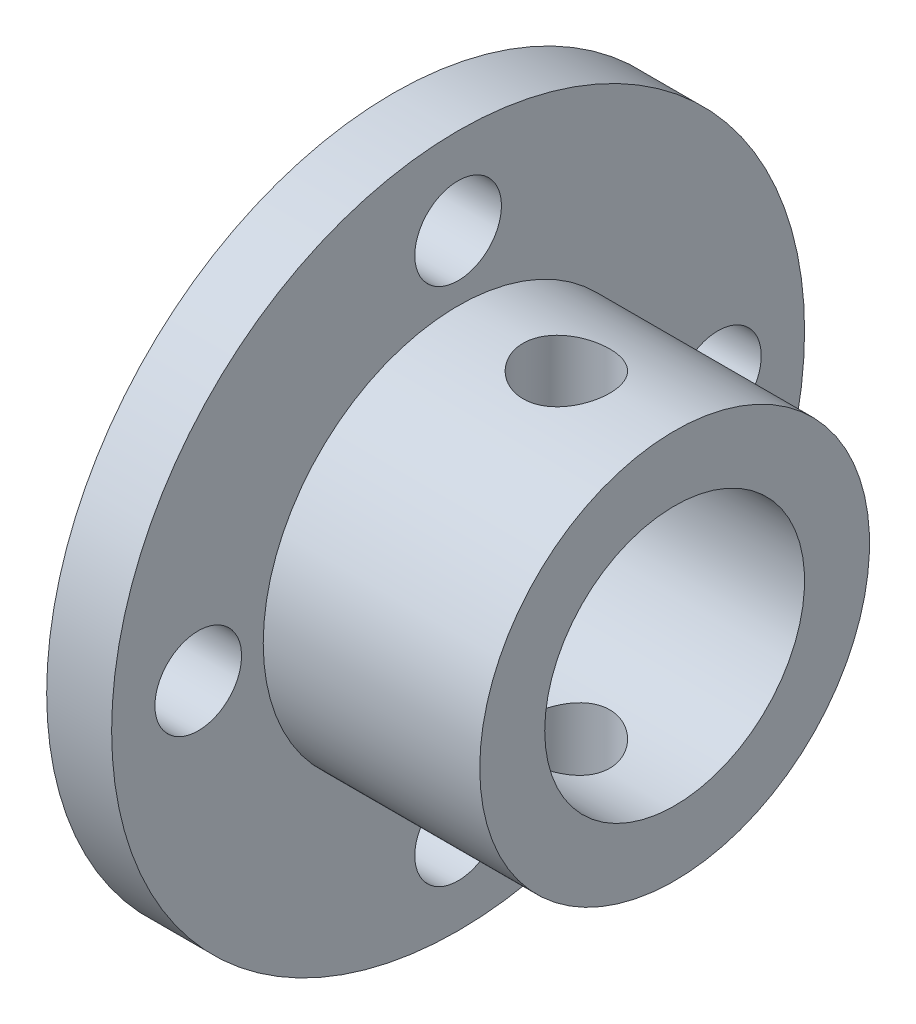
ISO-10303-21;
HEADER;
FILE_DESCRIPTION(('STEP AP214'),'2;1');
FILE_NAME('part.step','',(''),(''),'','','');
FILE_SCHEMA(('AUTOMOTIVE_DESIGN { 1 0 10303 214 1 1 1 1 }'));
ENDSEC;
DATA;
#1=APPLICATION_CONTEXT('core data for automotive mechanical design processes');
#2=APPLICATION_PROTOCOL_DEFINITION('international standard','automotive_design',2000,#1);
#3=PRODUCT_CONTEXT('',#1,'mechanical');
#4=PRODUCT('Part','Part','',(#3));
#5=PRODUCT_RELATED_PRODUCT_CATEGORY('part','',(#4));
#6=PRODUCT_DEFINITION_FORMATION('','',#4);
#7=PRODUCT_DEFINITION_CONTEXT('part definition',#1,'design');
#8=PRODUCT_DEFINITION('design','',#6,#7);
#9=PRODUCT_DEFINITION_SHAPE('','',#8);
#10=(LENGTH_UNIT() NAMED_UNIT(*) SI_UNIT(.MILLI.,.METRE.));
#11=(NAMED_UNIT(*) PLANE_ANGLE_UNIT() SI_UNIT($,.RADIAN.));
#12=(NAMED_UNIT(*) SI_UNIT($,.STERADIAN.) SOLID_ANGLE_UNIT());
#13=UNCERTAINTY_MEASURE_WITH_UNIT(LENGTH_MEASURE(1.E-05),#10,'distance_accuracy_value','');
#14=(GEOMETRIC_REPRESENTATION_CONTEXT(3) GLOBAL_UNCERTAINTY_ASSIGNED_CONTEXT((#13)) GLOBAL_UNIT_ASSIGNED_CONTEXT((#10,
#11,#12)) REPRESENTATION_CONTEXT('',''));
#15=CARTESIAN_POINT('',(0.,0.,0.));
#16=DIRECTION('',(0.,0.,1.));
#17=DIRECTION('',(1.,0.,0.));
#18=AXIS2_PLACEMENT_3D('',#15,#16,#17);
#19=CARTESIAN_POINT('',(0.,0.,0.));
#20=DIRECTION('',(-1.,0.,0.));
#21=DIRECTION('',(0.,0.,1.));
#22=AXIS2_PLACEMENT_3D('',#19,#20,#21);
#23=CYLINDRICAL_SURFACE('',#22,6.);
#24=CARTESIAN_POINT('',(8.,-5.65685424949238,2.));
#25=CARTESIAN_POINT('',(7.89106365032785,-5.65685389060868,2.00000051589543));
#26=CARTESIAN_POINT('',(7.78213040035281,-5.66003538581715,1.99106956737104));
#27=CARTESIAN_POINT('',(7.5674911580115,-5.6723514816251,1.95570226337762));
#28=CARTESIAN_POINT('',(7.46178570025506,-5.68148706284378,1.92926302433679));
#29=CARTESIAN_POINT('',(7.25674621400542,-5.70456407377583,1.85991097136981));
#30=CARTESIAN_POINT('',(7.15740014111456,-5.71849607942644,1.81703044280649));
#31=CARTESIAN_POINT('',(6.96727990290407,-5.74958244020649,1.71612325688276));
#32=CARTESIAN_POINT('',(6.87650763489273,-5.76673750607225,1.65809325772037));
#33=CARTESIAN_POINT('',(6.70256007532337,-5.80308978814946,1.52610229288576));
#34=CARTESIAN_POINT('',(6.61976914265654,-5.82233789689288,1.45164868275584));
#35=CARTESIAN_POINT('',(6.46758639755072,-5.86027729602006,1.28997533442879));
#36=CARTESIAN_POINT('',(6.39819673683526,-5.87896849657923,1.20275355010475));
#37=CARTESIAN_POINT('',(6.27304220534081,-5.91427733843598,1.01520901593002));
#38=CARTESIAN_POINT('',(6.21768005876408,-5.93082815403211,0.914603822449051));
#39=CARTESIAN_POINT('',(6.12481682974498,-5.95939173541966,0.704862445974948));
#40=CARTESIAN_POINT('',(6.08731093364619,-5.97140572406004,0.595728571374424));
#41=CARTESIAN_POINT('',(6.03252829073521,-5.98918150863813,0.376057634866989));
#42=CARTESIAN_POINT('',(6.01459310748598,-5.99514629555118,0.265701509705937));
#43=CARTESIAN_POINT('',(5.99736741327868,-6.00087216436496,0.0433957496481796));
#44=CARTESIAN_POINT('',(5.99807209669517,-6.00063484525791,-0.068553467087792));
#45=CARTESIAN_POINT('',(6.01768850913205,-5.99412079237463,-0.286207030387628));
#46=CARTESIAN_POINT('',(6.03588505694897,-5.98808129510235,-0.391984097183312));
#47=CARTESIAN_POINT('',(6.08878596196094,-5.97093934679463,-0.598886877644342));
#48=CARTESIAN_POINT('',(6.12349143795965,-5.95983655262364,-0.700012275558431));
#49=CARTESIAN_POINT('',(6.20884263461211,-5.93351340586449,-0.896304949683945));
#50=CARTESIAN_POINT('',(6.25969187709302,-5.91824085048031,-0.99137644193769));
#51=CARTESIAN_POINT('',(6.37571941089731,-5.88516786077838,-1.17184865105464));
#52=CARTESIAN_POINT('',(6.44090168665526,-5.86736672402934,-1.25724666877068));
#53=CARTESIAN_POINT('',(6.58734878691939,-5.83012383699793,-1.42020173310261));
#54=CARTESIAN_POINT('',(6.66922631568296,-5.81064430337755,-1.49720031413054));
#55=CARTESIAN_POINT('',(6.84489745145323,-5.77294670497801,-1.63655451919635));
#56=CARTESIAN_POINT('',(6.93869289145608,-5.75472883491231,-1.69890788656309));
#57=CARTESIAN_POINT('',(7.13730725120688,-5.72141050242225,-1.80797491007148));
#58=CARTESIAN_POINT('',(7.24226426263554,-5.70635818569496,-1.85445292724268));
#59=CARTESIAN_POINT('',(7.45914278842883,-5.6816330164877,-1.92888638653867));
#60=CARTESIAN_POINT('',(7.57106136241249,-5.67195790974185,-1.95684959149499));
#61=CARTESIAN_POINT('',(7.79327671082314,-5.6595927263117,-1.99232256419504));
#62=CARTESIAN_POINT('',(7.90341884949731,-5.65660720637512,-2.00069819101527));
#63=CARTESIAN_POINT('',(8.12355229822821,-5.65713344118369,-1.99921087781944));
#64=CARTESIAN_POINT('',(8.23354363204797,-5.66064401583629,-1.98935125045353));
#65=CARTESIAN_POINT('',(8.44631393142382,-5.67347236180599,-1.95245130310462));
#66=CARTESIAN_POINT('',(8.54921086030168,-5.68258650881681,-1.92601278796137));
#67=CARTESIAN_POINT('',(8.74908721247836,-5.70537107342046,-1.85742772512093));
#68=CARTESIAN_POINT('',(8.84606558318156,-5.71904229869679,-1.81527839272684));
#69=CARTESIAN_POINT('',(9.03476084169399,-5.74993755191574,-1.71494868147787));
#70=CARTESIAN_POINT('',(9.1262132852836,-5.76726051331257,-1.65630223671699));
#71=CARTESIAN_POINT('',(9.29829210476743,-5.8033153746193,-1.52517126111512));
#72=CARTESIAN_POINT('',(9.37891527732243,-5.82204768887589,-1.45268265099756));
#73=CARTESIAN_POINT('',(9.53105596818127,-5.85990077275698,-1.29178341180065));
#74=CARTESIAN_POINT('',(9.6019487800377,-5.87899687155793,-1.2027745410933));
#75=CARTESIAN_POINT('',(9.72783228469608,-5.91453703226218,-1.01365458280051));
#76=CARTESIAN_POINT('',(9.78282354232485,-5.9309811883539,-0.913543889729105));
#77=CARTESIAN_POINT('',(9.87484020972343,-5.95928811621206,-0.705559724864592));
#78=CARTESIAN_POINT('',(9.91198255429613,-5.97118060009062,-0.597742246642394));
#79=CARTESIAN_POINT('',(9.96745548412021,-5.98917221675549,-0.376916931692034));
#80=CARTESIAN_POINT('',(9.985792859761,-5.99527344068038,-0.26391098390778));
#81=CARTESIAN_POINT('',(10.0025241552113,-6.00083726472513,-0.0416306717200825));
#82=CARTESIAN_POINT('',(10.0018149078648,-6.00059840178878,0.0675694478400363));
#83=CARTESIAN_POINT('',(9.98268538370718,-5.99424393038796,0.284222290000347));
#84=CARTESIAN_POINT('',(9.96426654369446,-5.98812879867152,0.391675153638113));
#85=CARTESIAN_POINT('',(9.91083553084807,-5.97081829908825,0.600084238864117));
#86=CARTESIAN_POINT('',(9.87609156929413,-5.95970516722297,0.701116541825577));
#87=CARTESIAN_POINT('',(9.79124493780569,-5.9335432140899,0.89595670187959));
#88=CARTESIAN_POINT('',(9.74113948960597,-5.91849368096033,0.989763248284864));
#89=CARTESIAN_POINT('',(9.62486097579598,-5.88531737655762,1.17126803261757));
#90=CARTESIAN_POINT('',(9.55816262923672,-5.86709744983853,1.25861250311521));
#91=CARTESIAN_POINT('',(9.41148521768761,-5.82985977583759,1.42116205254485));
#92=CARTESIAN_POINT('',(9.33150191547454,-5.81084177546194,1.49636324324918));
#93=CARTESIAN_POINT('',(9.1567812888261,-5.77326559651197,1.63548361766623));
#94=CARTESIAN_POINT('',(9.06158897804672,-5.75475455977261,1.6988459319958));
#95=CARTESIAN_POINT('',(8.86133114619444,-5.72120386646031,1.80862868660223));
#96=CARTESIAN_POINT('',(8.75626821394067,-5.70616330322499,1.85505355363895));
#97=CARTESIAN_POINT('',(8.54407635196873,-5.68202668413029,1.92768765640833));
#98=CARTESIAN_POINT('',(8.43725547294926,-5.67269265714364,1.95471581829904));
#99=CARTESIAN_POINT('',(8.22028789906659,-5.66010767079037,1.99086864029853));
#100=CARTESIAN_POINT('',(8.11014236517858,-5.65685461234922,1.99999947839318));
#101=CARTESIAN_POINT('',(8.,-5.65685424949238,2.));
#102=B_SPLINE_CURVE_WITH_KNOTS('',3,(#24,#25,#26,#27,#28,#29,#30,#31,#32,#33,#34,#35,#36,#37,
#38,#39,#40,#41,#42,#43,#44,#45,#46,#47,#48,#49,#50,#51,#52,#53,#54,#55,#56,#57,#58,#59,#60,#61,
#62,#63,#64,#65,#66,#67,#68,#69,#70,#71,#72,#73,#74,#75,#76,#77,#78,#79,#80,#81,#82,#83,#84,#85,
#86,#87,#88,#89,#90,#91,#92,#93,#94,#95,#96,#97,#98,#99,#100,#101),.UNSPECIFIED.,.T.,.F.,(4,2,2,
2,2,2,2,2,2,2,2,2,2,2,2,2,2,2,2,2,2,2,2,2,2,2,2,2,2,2,2,2,2,2,2,2,2,2,4),(0.,0.326401169598711,
0.652856110030327,0.978673255001655,1.30456233237088,1.64202674855136,1.97954530343976,
2.32587012287314,2.67210152773578,3.00628637529868,3.34038506604654,3.66138009651138,
3.98239688378473,4.3076330972067,4.63295983748044,4.97360348727835,5.31429959224212,
5.65985279686111,6.00526102713231,6.33508582728879,6.66485071674467,6.98328791537552,
7.30178158293891,7.63037715471429,7.95906971324254,8.30357616342185,8.64807037515064,
8.99027582381703,9.33235766008313,9.65836169355271,9.98433928019562,10.3051391208086,
10.6259970152648,10.9587103904127,11.2915300886526,11.6373780547229,11.9831355653373,
12.3132642432538,12.6432789438093),.UNSPECIFIED.);
#103=CARTESIAN_POINT('',(8.,-5.65685424949238,2.));
#104=VERTEX_POINT('',#103);
#105=EDGE_CURVE('E107',#104,#104,#102,.T.);
#106=ORIENTED_EDGE('',*,*,#105,.T.);
#107=EDGE_LOOP('',(#106));
#108=FACE_BOUND('',#107,.T.);
#109=CARTESIAN_POINT('',(8.,5.65685424949238,2.));
#110=CARTESIAN_POINT('',(8.10893634967214,5.65685389060868,2.00000051589543));
#111=CARTESIAN_POINT('',(8.21786959964718,5.66003538581715,1.99106956737104));
#112=CARTESIAN_POINT('',(8.4325088419885,5.6723514816251,1.95570226337762));
#113=CARTESIAN_POINT('',(8.53821429974494,5.68148706284378,1.92926302433679));
#114=CARTESIAN_POINT('',(8.74325378599457,5.70456407377583,1.85991097136981));
#115=CARTESIAN_POINT('',(8.84259985888543,5.71849607942644,1.81703044280649));
#116=CARTESIAN_POINT('',(9.03272009709592,5.74958244020649,1.71612325688276));
#117=CARTESIAN_POINT('',(9.12349236510726,5.76673750607225,1.65809325772036));
#118=CARTESIAN_POINT('',(9.29743992467662,5.80308978814946,1.52610229288575));
#119=CARTESIAN_POINT('',(9.38023085734345,5.82233789689288,1.45164868275584));
#120=CARTESIAN_POINT('',(9.53241360244928,5.86027729602006,1.28997533442879));
#121=CARTESIAN_POINT('',(9.60180326316474,5.87896849657923,1.20275355010475));
#122=CARTESIAN_POINT('',(9.72695779465918,5.91427733843598,1.01520901593002));
#123=CARTESIAN_POINT('',(9.78231994123592,5.93082815403211,0.914603822449048));
#124=CARTESIAN_POINT('',(9.87518317025502,5.95939173541966,0.704862445974945));
#125=CARTESIAN_POINT('',(9.91268906635381,5.97140572406004,0.595728571374421));
#126=CARTESIAN_POINT('',(9.96747170926478,5.98918150863813,0.376057634866986));
#127=CARTESIAN_POINT('',(9.98540689251401,5.99514629555118,0.265701509705934));
#128=CARTESIAN_POINT('',(10.0026325867213,6.00087216436496,0.0433957496481766));
#129=CARTESIAN_POINT('',(10.0019279033048,6.00063484525791,-0.0685534670877949));
#130=CARTESIAN_POINT('',(9.98231149086794,5.99412079237463,-0.286207030387631));
#131=CARTESIAN_POINT('',(9.96411494305102,5.98808129510235,-0.391984097183315));
#132=CARTESIAN_POINT('',(9.91121403803905,5.97093934679463,-0.598886877644345));
#133=CARTESIAN_POINT('',(9.87650856204035,5.95983655262364,-0.700012275558434));
#134=CARTESIAN_POINT('',(9.79115736538788,5.93351340586448,-0.896304949683948));
#135=CARTESIAN_POINT('',(9.74030812290697,5.91824085048031,-0.991376441937692));
#136=CARTESIAN_POINT('',(9.62428058910268,5.88516786077838,-1.17184865105465));
#137=CARTESIAN_POINT('',(9.55909831334473,5.86736672402934,-1.25724666877068));
#138=CARTESIAN_POINT('',(9.4126512130806,5.83012383699793,-1.42020173310262));
#139=CARTESIAN_POINT('',(9.33077368431703,5.81064430337755,-1.49720031413055));
#140=CARTESIAN_POINT('',(9.15510254854675,5.77294670497801,-1.63655451919635));
#141=CARTESIAN_POINT('',(9.0613071085439,5.75472883491231,-1.69890788656309));
#142=CARTESIAN_POINT('',(8.86269274879311,5.72141050242225,-1.80797491007149));
#143=CARTESIAN_POINT('',(8.75773573736445,5.70635818569496,-1.85445292724268));
#144=CARTESIAN_POINT('',(8.54085721157116,5.6816330164877,-1.92888638653867));
#145=CARTESIAN_POINT('',(8.4289386375875,5.67195790974185,-1.95684959149499));
#146=CARTESIAN_POINT('',(8.20672328917685,5.6595927263117,-1.99232256419504));
#147=CARTESIAN_POINT('',(8.09658115050268,5.65660720637512,-2.00069819101527));
#148=CARTESIAN_POINT('',(7.87644770177178,5.65713344118369,-1.99921087781944));
#149=CARTESIAN_POINT('',(7.76645636795202,5.66064401583629,-1.98935125045353));
#150=CARTESIAN_POINT('',(7.55368606857618,5.67347236180599,-1.95245130310462));
#151=CARTESIAN_POINT('',(7.45078913969831,5.68258650881681,-1.92601278796137));
#152=CARTESIAN_POINT('',(7.25091278752163,5.70537107342046,-1.85742772512093));
#153=CARTESIAN_POINT('',(7.15393441681843,5.71904229869679,-1.81527839272684));
#154=CARTESIAN_POINT('',(6.965239158306,5.74993755191574,-1.71494868147787));
#155=CARTESIAN_POINT('',(6.87378671471639,5.76726051331257,-1.65630223671699));
#156=CARTESIAN_POINT('',(6.70170789523256,5.80331537461931,-1.52517126111511));
#157=CARTESIAN_POINT('',(6.62108472267756,5.82204768887589,-1.45268265099756));
#158=CARTESIAN_POINT('',(6.46894403181872,5.85990077275698,-1.29178341180065));
#159=CARTESIAN_POINT('',(6.3980512199623,5.87899687155793,-1.2027745410933));
#160=CARTESIAN_POINT('',(6.27216771530391,5.91453703226218,-1.01365458280051));
#161=CARTESIAN_POINT('',(6.21717645767515,5.9309811883539,-0.913543889729103));
#162=CARTESIAN_POINT('',(6.12515979027657,5.95928811621206,-0.70555972486459));
#163=CARTESIAN_POINT('',(6.08801744570387,5.97118060009062,-0.597742246642392));
#164=CARTESIAN_POINT('',(6.03254451587979,5.98917221675549,-0.376916931692031));
#165=CARTESIAN_POINT('',(6.01420714023899,5.99527344068038,-0.263910983907777));
#166=CARTESIAN_POINT('',(5.99747584478871,6.00083726472513,-0.0416306717200801));
#167=CARTESIAN_POINT('',(5.99818509213524,6.00059840178878,0.0675694478400388));
#168=CARTESIAN_POINT('',(6.01731461629281,5.99424393038796,0.284222290000349));
#169=CARTESIAN_POINT('',(6.03573345630554,5.98812879867152,0.391675153638115));
#170=CARTESIAN_POINT('',(6.08916446915192,5.97081829908825,0.600084238864119));
#171=CARTESIAN_POINT('',(6.12390843070586,5.95970516722297,0.701116541825579));
#172=CARTESIAN_POINT('',(6.20875506219431,5.9335432140899,0.895956701879592));
#173=CARTESIAN_POINT('',(6.25886051039402,5.91849368096033,0.989763248284866));
#174=CARTESIAN_POINT('',(6.37513902420401,5.88531737655762,1.17126803261757));
#175=CARTESIAN_POINT('',(6.44183737076328,5.86709744983853,1.25861250311522));
#176=CARTESIAN_POINT('',(6.58851478231239,5.82985977583759,1.42116205254486));
#177=CARTESIAN_POINT('',(6.66849808452545,5.81084177546194,1.49636324324919));
#178=CARTESIAN_POINT('',(6.8432187111739,5.77326559651196,1.63548361766624));
#179=CARTESIAN_POINT('',(6.93841102195328,5.75475455977261,1.6988459319958));
#180=CARTESIAN_POINT('',(7.13866885380556,5.72120386646031,1.80862868660223));
#181=CARTESIAN_POINT('',(7.24373178605933,5.70616330322499,1.85505355363895));
#182=CARTESIAN_POINT('',(7.45592364803126,5.68202668413029,1.92768765640833));
#183=CARTESIAN_POINT('',(7.56274452705073,5.67269265714364,1.95471581829904));
#184=CARTESIAN_POINT('',(7.7797121009334,5.66010767079037,1.99086864029853));
#185=CARTESIAN_POINT('',(7.88985763482142,5.65685461234922,1.99999947839318));
#186=CARTESIAN_POINT('',(8.,5.65685424949238,2.));
#187=B_SPLINE_CURVE_WITH_KNOTS('',3,(#109,#110,#111,#112,#113,#114,#115,#116,#117,#118,#119,
#120,#121,#122,#123,#124,#125,#126,#127,#128,#129,#130,#131,#132,#133,#134,#135,#136,#137,#138,
#139,#140,#141,#142,#143,#144,#145,#146,#147,#148,#149,#150,#151,#152,#153,#154,#155,#156,#157,
#158,#159,#160,#161,#162,#163,#164,#165,#166,#167,#168,#169,#170,#171,#172,#173,#174,#175,#176,
#177,#178,#179,#180,#181,#182,#183,#184,#185,#186),.UNSPECIFIED.,.T.,.F.,(4,2,2,2,2,2,2,2,2,2,2,
2,2,2,2,2,2,2,2,2,2,2,2,2,2,2,2,2,2,2,2,2,2,2,2,2,2,2,4),(0.,0.326401169598711,
0.652856110030329,0.978673255001656,1.30456233237089,1.64202674855136,1.97954530343976,
2.32587012287315,2.67210152773578,3.00628637529869,3.34038506604655,3.66138009651138,
3.98239688378473,4.3076330972067,4.63295983748044,4.97360348727835,5.31429959224212,
5.65985279686111,6.00526102713232,6.33508582728879,6.66485071674468,6.98328791537552,
7.30178158293891,7.6303771547143,7.95906971324255,8.30357616342185,8.64807037515065,
8.99027582381703,9.33235766008313,9.65836169355271,9.98433928019562,10.3051391208086,
10.6259970152649,10.9587103904127,11.2915300886526,11.6373780547229,11.9831355653373,
12.3132642432538,12.6432789438093),.UNSPECIFIED.);
#188=CARTESIAN_POINT('',(8.,5.65685424949238,2.));
#189=VERTEX_POINT('',#188);
#190=EDGE_CURVE('E101',#189,#189,#187,.T.);
#191=ORIENTED_EDGE('',*,*,#190,.T.);
#192=EDGE_LOOP('',(#191));
#193=FACE_BOUND('',#192,.T.);
#194=CARTESIAN_POINT('',(13.,0.,0.));
#195=DIRECTION('',(-1.,0.,0.));
#196=DIRECTION('',(0.,0.,1.));
#197=AXIS2_PLACEMENT_3D('',#194,#195,#196);
#198=CIRCLE('',#197,6.);
#199=CARTESIAN_POINT('',(13.,0.,6.));
#200=VERTEX_POINT('',#199);
#201=EDGE_CURVE('E77',#200,#200,#198,.T.);
#202=ORIENTED_EDGE('',*,*,#201,.F.);
#203=EDGE_LOOP('',(#202));
#204=FACE_BOUND('',#203,.T.);
#205=CARTESIAN_POINT('',(0.,0.,0.));
#206=DIRECTION('',(-1.,0.,0.));
#207=DIRECTION('',(0.,0.,1.));
#208=AXIS2_PLACEMENT_3D('',#205,#206,#207);
#209=CIRCLE('',#208,6.);
#210=CARTESIAN_POINT('',(0.,0.,6.));
#211=VERTEX_POINT('',#210);
#212=EDGE_CURVE('E10',#211,#211,#209,.T.);
#213=ORIENTED_EDGE('',*,*,#212,.T.);
#214=EDGE_LOOP('',(#213));
#215=FACE_BOUND('',#214,.T.);
#216=ADVANCED_FACE('F37',(#108,#193,#204,#215),#23,.F.);
#217=CARTESIAN_POINT('',(0.,6.,0.));
#218=DIRECTION('',(1.,0.,0.));
#219=DIRECTION('',(0.,0.,-1.));
#220=AXIS2_PLACEMENT_3D('',#217,#218,#219);
#221=PLANE('',#220);
#222=CARTESIAN_POINT('',(0.,12.,0.));
#223=DIRECTION('',(-1.,0.,0.));
#224=DIRECTION('',(0.,0.,1.));
#225=AXIS2_PLACEMENT_3D('',#222,#223,#224);
#226=CIRCLE('',#225,2.);
#227=CARTESIAN_POINT('',(0.,12.,2.));
#228=VERTEX_POINT('',#227);
#229=EDGE_CURVE('E66',#228,#228,#226,.T.);
#230=ORIENTED_EDGE('',*,*,#229,.F.);
#231=EDGE_LOOP('',(#230));
#232=FACE_BOUND('',#231,.T.);
#233=CARTESIAN_POINT('',(0.,-3.41060513164848E-13,-11.9999999999997));
#234=DIRECTION('',(-1.,0.,0.));
#235=DIRECTION('',(0.,0.,1.));
#236=AXIS2_PLACEMENT_3D('',#233,#234,#235);
#237=CIRCLE('',#236,2.00000000000055);
#238=CARTESIAN_POINT('',(0.,-3.41060513164848E-13,-9.99999999999912));
#239=VERTEX_POINT('',#238);
#240=EDGE_CURVE('E118',#239,#239,#237,.T.);
#241=ORIENTED_EDGE('',*,*,#240,.F.);
#242=EDGE_LOOP('',(#241));
#243=FACE_BOUND('',#242,.T.);
#244=CARTESIAN_POINT('',(0.,-12.,6.79181874011743E-13));
#245=DIRECTION('',(-1.,0.,0.));
#246=DIRECTION('',(0.,0.,1.));
#247=AXIS2_PLACEMENT_3D('',#244,#245,#246);
#248=CIRCLE('',#247,2.00000000000073);
#249=CARTESIAN_POINT('',(0.,-12.,2.00000000000141));
#250=VERTEX_POINT('',#249);
#251=EDGE_CURVE('E122',#250,#250,#248,.T.);
#252=ORIENTED_EDGE('',*,*,#251,.F.);
#253=EDGE_LOOP('',(#252));
#254=FACE_BOUND('',#253,.T.);
#255=CARTESIAN_POINT('',(0.,3.39590937005871E-13,12.0000000000003));
#256=DIRECTION('',(-1.,0.,0.));
#257=DIRECTION('',(0.,0.,1.));
#258=AXIS2_PLACEMENT_3D('',#255,#256,#257);
#259=CIRCLE('',#258,2.00000000000027);
#260=CARTESIAN_POINT('',(0.,3.39590937005871E-13,14.0000000000006));
#261=VERTEX_POINT('',#260);
#262=EDGE_CURVE('E114',#261,#261,#259,.T.);
#263=ORIENTED_EDGE('',*,*,#262,.F.);
#264=EDGE_LOOP('',(#263));
#265=FACE_BOUND('',#264,.T.);
#266=ORIENTED_EDGE('',*,*,#212,.F.);
#267=EDGE_LOOP('',(#266));
#268=FACE_BOUND('',#267,.T.);
#269=CARTESIAN_POINT('',(0.,0.,0.));
#270=DIRECTION('',(-1.,0.,0.));
#271=DIRECTION('',(0.,0.,1.));
#272=AXIS2_PLACEMENT_3D('',#269,#270,#271);
#273=CIRCLE('',#272,16.);
#274=CARTESIAN_POINT('',(0.,0.,16.));
#275=VERTEX_POINT('',#274);
#276=EDGE_CURVE('E51',#275,#275,#273,.T.);
#277=ORIENTED_EDGE('',*,*,#276,.T.);
#278=EDGE_LOOP('',(#277));
#279=FACE_BOUND('',#278,.T.);
#280=ADVANCED_FACE('F163',(#232,#243,#254,#265,#268,#279),#221,.F.);
#281=CARTESIAN_POINT('',(0.,0.,0.));
#282=DIRECTION('',(-1.,0.,0.));
#283=DIRECTION('',(0.,0.,1.));
#284=AXIS2_PLACEMENT_3D('',#281,#282,#283);
#285=CYLINDRICAL_SURFACE('',#284,16.);
#286=ORIENTED_EDGE('',*,*,#276,.F.);
#287=EDGE_LOOP('',(#286));
#288=FACE_BOUND('',#287,.T.);
#289=CARTESIAN_POINT('',(3.,0.,0.));
#290=DIRECTION('',(-1.,0.,0.));
#291=DIRECTION('',(0.,0.,1.));
#292=AXIS2_PLACEMENT_3D('',#289,#290,#291);
#293=CIRCLE('',#292,16.);
#294=CARTESIAN_POINT('',(3.,0.,16.));
#295=VERTEX_POINT('',#294);
#296=EDGE_CURVE('E57',#295,#295,#293,.T.);
#297=ORIENTED_EDGE('',*,*,#296,.T.);
#298=EDGE_LOOP('',(#297));
#299=FACE_BOUND('',#298,.T.);
#300=ADVANCED_FACE('F143',(#288,#299),#285,.T.);
#301=CARTESIAN_POINT('',(3.,16.,0.));
#302=DIRECTION('',(-1.,0.,0.));
#303=DIRECTION('',(0.,0.,1.));
#304=AXIS2_PLACEMENT_3D('',#301,#302,#303);
#305=PLANE('',#304);
#306=CARTESIAN_POINT('',(3.,12.,0.));
#307=DIRECTION('',(-1.,0.,0.));
#308=DIRECTION('',(0.,0.,1.));
#309=AXIS2_PLACEMENT_3D('',#306,#307,#308);
#310=CIRCLE('',#309,2.);
#311=CARTESIAN_POINT('',(3.,12.,2.));
#312=VERTEX_POINT('',#311);
#313=EDGE_CURVE('E74',#312,#312,#310,.T.);
#314=ORIENTED_EDGE('',*,*,#313,.T.);
#315=EDGE_LOOP('',(#314));
#316=FACE_BOUND('',#315,.T.);
#317=CARTESIAN_POINT('',(3.,-3.41060513164848E-13,-11.9999999999997));
#318=DIRECTION('',(-1.,0.,0.));
#319=DIRECTION('',(0.,0.,1.));
#320=AXIS2_PLACEMENT_3D('',#317,#318,#319);
#321=CIRCLE('',#320,2.00000000000055);
#322=CARTESIAN_POINT('',(3.,-3.41060513164848E-13,-9.99999999999912));
#323=VERTEX_POINT('',#322);
#324=EDGE_CURVE('E70',#323,#323,#321,.T.);
#325=ORIENTED_EDGE('',*,*,#324,.T.);
#326=EDGE_LOOP('',(#325));
#327=FACE_BOUND('',#326,.T.);
#328=CARTESIAN_POINT('',(3.,-12.,6.79181874011743E-13));
#329=DIRECTION('',(-1.,0.,0.));
#330=DIRECTION('',(0.,0.,1.));
#331=AXIS2_PLACEMENT_3D('',#328,#329,#330);
#332=CIRCLE('',#331,2.00000000000073);
#333=CARTESIAN_POINT('',(3.,-12.,2.00000000000141));
#334=VERTEX_POINT('',#333);
#335=EDGE_CURVE('E65',#334,#334,#332,.T.);
#336=ORIENTED_EDGE('',*,*,#335,.T.);
#337=EDGE_LOOP('',(#336));
#338=FACE_BOUND('',#337,.T.);
#339=CARTESIAN_POINT('',(3.,3.39590937005871E-13,12.0000000000003));
#340=DIRECTION('',(-1.,0.,0.));
#341=DIRECTION('',(0.,0.,1.));
#342=AXIS2_PLACEMENT_3D('',#339,#340,#341);
#343=CIRCLE('',#342,2.00000000000027);
#344=CARTESIAN_POINT('',(3.,3.39590937005871E-13,14.0000000000006));
#345=VERTEX_POINT('',#344);
#346=EDGE_CURVE('E61',#345,#345,#343,.T.);
#347=ORIENTED_EDGE('',*,*,#346,.T.);
#348=EDGE_LOOP('',(#347));
#349=FACE_BOUND('',#348,.T.);
#350=ORIENTED_EDGE('',*,*,#296,.F.);
#351=EDGE_LOOP('',(#350));
#352=FACE_BOUND('',#351,.T.);
#353=CARTESIAN_POINT('',(3.,0.,0.));
#354=DIRECTION('',(-1.,0.,0.));
#355=DIRECTION('',(0.,0.,1.));
#356=AXIS2_PLACEMENT_3D('',#353,#354,#355);
#357=CIRCLE('',#356,9.);
#358=CARTESIAN_POINT('',(3.,0.,9.));
#359=VERTEX_POINT('',#358);
#360=EDGE_CURVE('E136',#359,#359,#357,.T.);
#361=ORIENTED_EDGE('',*,*,#360,.T.);
#362=EDGE_LOOP('',(#361));
#363=FACE_BOUND('',#362,.T.);
#364=ADVANCED_FACE('F145',(#316,#327,#338,#349,#352,#363),#305,.F.);
#365=CARTESIAN_POINT('',(0.,0.,0.));
#366=DIRECTION('',(-1.,0.,0.));
#367=DIRECTION('',(0.,0.,1.));
#368=AXIS2_PLACEMENT_3D('',#365,#366,#367);
#369=CYLINDRICAL_SURFACE('',#368,9.);
#370=CARTESIAN_POINT('',(8.,-8.77496438739212,2.));
#371=CARTESIAN_POINT('',(8.11084236771599,-8.77496662645733,1.99999624947948));
#372=CARTESIAN_POINT('',(8.22172941265847,-8.7770874535984,1.99075413145665));
#373=CARTESIAN_POINT('',(8.44034682608887,-8.78532539051412,1.95407223666285));
#374=CARTESIAN_POINT('',(8.54807490341598,-8.7914453293773,1.92661957701425));
#375=CARTESIAN_POINT('',(8.75718042226966,-8.80695492376764,1.85442638312279));
#376=CARTESIAN_POINT('',(8.8585648140004,-8.81634092424592,1.8097051680061));
#377=CARTESIAN_POINT('',(9.05239500705713,-8.83732066308218,1.70430003435311));
#378=CARTESIAN_POINT('',(9.14484093174294,-8.84891437096502,1.64361633615812));
#379=CARTESIAN_POINT('',(9.31978257136839,-8.87322903283376,1.50688107459123));
#380=CARTESIAN_POINT('',(9.40209976211973,-8.88596479825903,1.43060369779219));
#381=CARTESIAN_POINT('',(9.55288275243903,-8.91099903447158,1.26533367886365));
#382=CARTESIAN_POINT('',(9.62134745364365,-8.92329747051937,1.17634002941518));
#383=CARTESIAN_POINT('',(9.74319075139532,-8.94623292801725,0.986963945237562));
#384=CARTESIAN_POINT('',(9.79639724945312,-8.95685043407434,0.886468216533074));
#385=CARTESIAN_POINT('',(9.88509980172048,-8.97506024335485,0.677686335651942));
#386=CARTESIAN_POINT('',(9.92059790847101,-8.98265289716175,0.569401088006952));
#387=CARTESIAN_POINT('',(9.97231343293885,-8.99385284467252,0.349970796328335));
#388=CARTESIAN_POINT('',(9.98883310920039,-8.99752254926932,0.238900228261922));
#389=CARTESIAN_POINT('',(10.0030682708724,-9.00067948952038,0.0155076577860225));
#390=CARTESIAN_POINT('',(10.0007859739338,-9.00016721842944,-0.0968141954765457));
#391=CARTESIAN_POINT('',(9.97770627750396,-8.99506549351281,-0.317435920934347));
#392=CARTESIAN_POINT('',(9.95723472090889,-8.99054779604674,-0.425771784327153));
#393=CARTESIAN_POINT('',(9.89887733244483,-8.97802477302305,-0.637430845543417));
#394=CARTESIAN_POINT('',(9.86099069674674,-8.97001928648017,-0.740753811742809));
#395=CARTESIAN_POINT('',(9.76859302589905,-8.95130538605655,-0.940353769390932));
#396=CARTESIAN_POINT('',(9.71395928345555,-8.94057712552793,-1.03657202089402));
#397=CARTESIAN_POINT('',(9.589709906051,-8.91759271684017,-1.21859313654481));
#398=CARTESIAN_POINT('',(9.52009216893003,-8.9053363543996,-1.30439453662954));
#399=CARTESIAN_POINT('',(9.36607980614704,-8.88033165726825,-1.46508498958083));
#400=CARTESIAN_POINT('',(9.28140002402915,-8.86757840960138,-1.53970021847621));
#401=CARTESIAN_POINT('',(9.10059725238292,-8.84326321441832,-1.67372303020546));
#402=CARTESIAN_POINT('',(9.00447393222571,-8.83170130134042,-1.73313017348813));
#403=CARTESIAN_POINT('',(8.80306011165132,-8.81106433565089,-1.83517765915972));
#404=CARTESIAN_POINT('',(8.69774177719533,-8.8019972048296,-1.8777647744073));
#405=CARTESIAN_POINT('',(8.48119382871771,-8.78748514090364,-1.94455269523168));
#406=CARTESIAN_POINT('',(8.36996518914267,-8.78203961268514,-1.96875652170475));
#407=CARTESIAN_POINT('',(8.14726001294026,-8.77550908494628,-1.99766298900203));
#408=CARTESIAN_POINT('',(8.03583786896013,-8.77433480250859,-2.00276498767797));
#409=CARTESIAN_POINT('',(7.81373507703743,-8.77623864525492,-1.99440547424347));
#410=CARTESIAN_POINT('',(7.70305437694156,-8.77931646812093,-1.98094528187579));
#411=CARTESIAN_POINT('',(7.48697646250341,-8.78929328275126,-1.93619037322696));
#412=CARTESIAN_POINT('',(7.3815310247037,-8.79614483669032,-1.90511692654433));
#413=CARTESIAN_POINT('',(7.17734336887131,-8.81285408505846,-1.82625775138724));
#414=CARTESIAN_POINT('',(7.07860181050054,-8.82271207479827,-1.77847038110013));
#415=CARTESIAN_POINT('',(6.88890039822357,-8.84451874051647,-1.66666470166548));
#416=CARTESIAN_POINT('',(6.79808868501493,-8.85649807643978,-1.60240114470844));
#417=CARTESIAN_POINT('',(6.62839164259131,-8.88111742013187,-1.45978704293772));
#418=CARTESIAN_POINT('',(6.54950784697142,-8.8937575125747,-1.38143468953093));
#419=CARTESIAN_POINT('',(6.40434865649141,-8.91856933927248,-1.21105721461462));
#420=CARTESIAN_POINT('',(6.33834596413054,-8.93072732731512,-1.11879740983627));
#421=CARTESIAN_POINT('',(6.22277586576598,-8.95294911443443,-0.924268162142588));
#422=CARTESIAN_POINT('',(6.17320767936655,-8.96301301294089,-0.821999194813061));
#423=CARTESIAN_POINT('',(6.09228988536659,-8.97985488719582,-0.611001900003295));
#424=CARTESIAN_POINT('',(6.06082280410583,-8.98665400218589,-0.502320388174407));
#425=CARTESIAN_POINT('',(6.01663483998347,-8.99629176699512,-0.28104508679559));
#426=CARTESIAN_POINT('',(6.00391113928615,-8.99913101212837,-0.168451887925187));
#427=CARTESIAN_POINT('',(5.99770121763104,-9.00051075200279,0.0548648455403726));
#428=CARTESIAN_POINT('',(6.00380836934073,-8.99914211230489,0.165576705736198));
#429=CARTESIAN_POINT('',(6.03417495055675,-8.9924552646312,0.384354041366151));
#430=CARTESIAN_POINT('',(6.05843403309503,-8.98713713214866,0.492419567343289));
#431=CARTESIAN_POINT('',(6.12421835719471,-8.97315637064447,0.702510284786642));
#432=CARTESIAN_POINT('',(6.16568422390071,-8.9645052499262,0.804554882640544));
#433=CARTESIAN_POINT('',(6.26464780353945,-8.94478087317809,1.00029152809303));
#434=CARTESIAN_POINT('',(6.32214712618022,-8.93370737397322,1.0939827357907));
#435=CARTESIAN_POINT('',(6.45286227746307,-8.91007482615536,1.27233089950998));
#436=CARTESIAN_POINT('',(6.52636303568944,-8.89749099486293,1.35677575839294));
#437=CARTESIAN_POINT('',(6.68642213645235,-8.87238707177687,1.51227173235308));
#438=CARTESIAN_POINT('',(6.77298363579009,-8.85986699615144,1.58331959999146));
#439=CARTESIAN_POINT('',(6.95815449978795,-8.83611370166478,1.71095851141984));
#440=CARTESIAN_POINT('',(7.05691461674068,-8.82490079106851,1.76733485857975));
#441=CARTESIAN_POINT('',(7.26273689537116,-8.80528840186491,1.86260026324667));
#442=CARTESIAN_POINT('',(7.36979204410565,-8.79688657793932,1.90150390773299));
#443=CARTESIAN_POINT('',(7.56410647405525,-8.78537621740405,1.95389349465735));
#444=CARTESIAN_POINT('',(7.65032342727348,-8.78149804514396,1.97114982047985));
#445=CARTESIAN_POINT('',(7.82435095658017,-8.77629130915146,1.99420426170609));
#446=CARTESIAN_POINT('',(7.91216144967045,-8.77496261301427,2.00000297215128));
#447=CARTESIAN_POINT('',(8.,-8.77496438739212,2.));
#448=B_SPLINE_CURVE_WITH_KNOTS('',3,(#370,#371,#372,#373,#374,#375,#376,#377,#378,#379,#380,
#381,#382,#383,#384,#385,#386,#387,#388,#389,#390,#391,#392,#393,#394,#395,#396,#397,#398,#399,
#400,#401,#402,#403,#404,#405,#406,#407,#408,#409,#410,#411,#412,#413,#414,#415,#416,#417,#418,
#419,#420,#421,#422,#423,#424,#425,#426,#427,#428,#429,#430,#431,#432,#433,#434,#435,#436,#437,
#438,#439,#440,#441,#442,#443,#444,#445,#446,#447),.UNSPECIFIED.,.T.,.F.,(4,2,2,2,2,2,2,2,2,2,2,
2,2,2,2,2,2,2,2,2,2,2,2,2,2,2,2,2,2,2,2,2,2,2,2,2,2,2,4),(0.,0.332205117020653,
0.664645500445896,0.99671504007781,1.32877999616248,1.66604593919643,2.00333861356302,
2.34429812642809,2.68521811023267,3.02062971478989,3.35600175886082,3.68548441840912,
4.0149822874403,4.34695458006495,4.67897347670087,5.01812047297981,5.35727727033735,
5.69749889450325,6.0376645984937,6.37067749516634,6.70366671636337,7.03256257950694,
7.3614907592462,7.69563228727099,8.02981674004573,8.37045046043533,8.71106800344853,
9.04944929455634,9.38777970902403,9.71885587565259,10.0499257140336,10.3798625177933,
10.7098324580937,11.0462446945479,11.3827383729968,11.7239097153546,12.0647957010371,
12.3280698629932,12.5913303516713),.UNSPECIFIED.);
#449=CARTESIAN_POINT('',(8.,-8.77496438739212,2.));
#450=VERTEX_POINT('',#449);
#451=EDGE_CURVE('E41',#450,#450,#448,.T.);
#452=ORIENTED_EDGE('',*,*,#451,.T.);
#453=EDGE_LOOP('',(#452));
#454=FACE_BOUND('',#453,.T.);
#455=CARTESIAN_POINT('',(8.,8.77496438739212,2.));
#456=CARTESIAN_POINT('',(7.88915763228401,8.77496662645733,1.99999624947948));
#457=CARTESIAN_POINT('',(7.77827058734152,8.7770874535984,1.99075413145665));
#458=CARTESIAN_POINT('',(7.55965317391113,8.78532539051412,1.95407223666285));
#459=CARTESIAN_POINT('',(7.45192509658402,8.7914453293773,1.92661957701425));
#460=CARTESIAN_POINT('',(7.24281957773033,8.80695492376764,1.85442638312279));
#461=CARTESIAN_POINT('',(7.1414351859996,8.81634092424592,1.8097051680061));
#462=CARTESIAN_POINT('',(6.94760499294287,8.83732066308218,1.70430003435311));
#463=CARTESIAN_POINT('',(6.85515906825706,8.84891437096502,1.64361633615812));
#464=CARTESIAN_POINT('',(6.68021742863161,8.87322903283376,1.50688107459123));
#465=CARTESIAN_POINT('',(6.59790023788027,8.88596479825903,1.4306036977922));
#466=CARTESIAN_POINT('',(6.44711724756096,8.91099903447158,1.26533367886365));
#467=CARTESIAN_POINT('',(6.37865254635634,8.92329747051937,1.17634002941518));
#468=CARTESIAN_POINT('',(6.25680924860468,8.94623292801725,0.986963945237564));
#469=CARTESIAN_POINT('',(6.20360275054687,8.95685043407434,0.886468216533077));
#470=CARTESIAN_POINT('',(6.11490019827951,8.97506024335485,0.677686335651945));
#471=CARTESIAN_POINT('',(6.07940209152898,8.98265289716175,0.569401088006955));
#472=CARTESIAN_POINT('',(6.02768656706115,8.99385284467252,0.349970796328337));
#473=CARTESIAN_POINT('',(6.0111668907996,8.99752254926932,0.238900228261923));
#474=CARTESIAN_POINT('',(5.99693172912757,9.00067948952038,0.0155076577860246));
#475=CARTESIAN_POINT('',(5.99921402606618,9.00016721842944,-0.0968141954765435));
#476=CARTESIAN_POINT('',(6.02229372249603,8.99506549351281,-0.317435920934345));
#477=CARTESIAN_POINT('',(6.0427652790911,8.99054779604675,-0.425771784327151));
#478=CARTESIAN_POINT('',(6.10112266755516,8.97802477302305,-0.637430845543415));
#479=CARTESIAN_POINT('',(6.13900930325325,8.97001928648017,-0.740753811742807));
#480=CARTESIAN_POINT('',(6.23140697410094,8.95130538605655,-0.94035376939093));
#481=CARTESIAN_POINT('',(6.28604071654444,8.94057712552793,-1.03657202089402));
#482=CARTESIAN_POINT('',(6.41029009394899,8.91759271684017,-1.21859313654481));
#483=CARTESIAN_POINT('',(6.47990783106996,8.9053363543996,-1.30439453662954));
#484=CARTESIAN_POINT('',(6.63392019385295,8.88033165726825,-1.46508498958083));
#485=CARTESIAN_POINT('',(6.71859997597084,8.86757840960138,-1.53970021847621));
#486=CARTESIAN_POINT('',(6.89940274761707,8.84326321441832,-1.67372303020546));
#487=CARTESIAN_POINT('',(6.99552606777428,8.83170130134042,-1.73313017348813));
#488=CARTESIAN_POINT('',(7.19693988834867,8.81106433565089,-1.83517765915972));
#489=CARTESIAN_POINT('',(7.30225822280466,8.8019972048296,-1.8777647744073));
#490=CARTESIAN_POINT('',(7.51880617128228,8.78748514090364,-1.94455269523168));
#491=CARTESIAN_POINT('',(7.63003481085732,8.78203961268514,-1.96875652170475));
#492=CARTESIAN_POINT('',(7.85273998705973,8.77550908494628,-1.99766298900203));
#493=CARTESIAN_POINT('',(7.96416213103986,8.77433480250859,-2.00276498767796));
#494=CARTESIAN_POINT('',(8.18626492296256,8.77623864525492,-1.99440547424347));
#495=CARTESIAN_POINT('',(8.29694562305843,8.77931646812093,-1.98094528187579));
#496=CARTESIAN_POINT('',(8.51302353749658,8.78929328275126,-1.93619037322696));
#497=CARTESIAN_POINT('',(8.61846897529629,8.79614483669032,-1.90511692654434));
#498=CARTESIAN_POINT('',(8.82265663112868,8.81285408505847,-1.82625775138724));
#499=CARTESIAN_POINT('',(8.92139818949945,8.82271207479827,-1.77847038110013));
#500=CARTESIAN_POINT('',(9.11109960177642,8.84451874051647,-1.66666470166548));
#501=CARTESIAN_POINT('',(9.20191131498506,8.85649807643978,-1.60240114470844));
#502=CARTESIAN_POINT('',(9.37160835740869,8.88111742013187,-1.45978704293772));
#503=CARTESIAN_POINT('',(9.45049215302858,8.8937575125747,-1.38143468953094));
#504=CARTESIAN_POINT('',(9.59565134350859,8.91856933927248,-1.21105721461462));
#505=CARTESIAN_POINT('',(9.66165403586945,8.93072732731512,-1.11879740983628));
#506=CARTESIAN_POINT('',(9.77722413423401,8.95294911443443,-0.924268162142589));
#507=CARTESIAN_POINT('',(9.82679232063344,8.96301301294089,-0.821999194813063));
#508=CARTESIAN_POINT('',(9.9077101146334,8.97985488719582,-0.611001900003297));
#509=CARTESIAN_POINT('',(9.93917719589416,8.98665400218589,-0.502320388174408));
#510=CARTESIAN_POINT('',(9.98336516001653,8.99629176699512,-0.281045086795591));
#511=CARTESIAN_POINT('',(9.99608886071384,8.99913101212837,-0.168451887925188));
#512=CARTESIAN_POINT('',(10.002298782369,9.00051075200279,0.0548648455403712));
#513=CARTESIAN_POINT('',(9.99619163065926,8.99914211230489,0.165576705736197));
#514=CARTESIAN_POINT('',(9.96582504944325,8.9924552646312,0.38435404136615));
#515=CARTESIAN_POINT('',(9.94156596690496,8.98713713214866,0.492419567343288));
#516=CARTESIAN_POINT('',(9.87578164280528,8.97315637064447,0.702510284786641));
#517=CARTESIAN_POINT('',(9.83431577609928,8.9645052499262,0.804554882640543));
#518=CARTESIAN_POINT('',(9.73535219646054,8.94478087317809,1.00029152809303));
#519=CARTESIAN_POINT('',(9.67785287381977,8.93370737397322,1.0939827357907));
#520=CARTESIAN_POINT('',(9.54713772253693,8.91007482615536,1.27233089950998));
#521=CARTESIAN_POINT('',(9.47363696431055,8.89749099486293,1.35677575839294));
#522=CARTESIAN_POINT('',(9.31357786354764,8.87238707177687,1.51227173235308));
#523=CARTESIAN_POINT('',(9.22701636420991,8.85986699615144,1.58331959999146));
#524=CARTESIAN_POINT('',(9.04184550021205,8.83611370166478,1.71095851141984));
#525=CARTESIAN_POINT('',(8.94308538325931,8.82490079106851,1.76733485857975));
#526=CARTESIAN_POINT('',(8.73726310462883,8.80528840186491,1.86260026324667));
#527=CARTESIAN_POINT('',(8.63020795589434,8.79688657793932,1.90150390773299));
#528=CARTESIAN_POINT('',(8.43589352594475,8.78537621740405,1.95389349465735));
#529=CARTESIAN_POINT('',(8.34967657272651,8.78149804514396,1.97114982047985));
#530=CARTESIAN_POINT('',(8.17564904341983,8.77629130915146,1.99420426170609));
#531=CARTESIAN_POINT('',(8.08783855032954,8.77496261301427,2.00000297215128));
#532=CARTESIAN_POINT('',(8.,8.77496438739212,2.));
#533=B_SPLINE_CURVE_WITH_KNOTS('',3,(#455,#456,#457,#458,#459,#460,#461,#462,#463,#464,#465,
#466,#467,#468,#469,#470,#471,#472,#473,#474,#475,#476,#477,#478,#479,#480,#481,#482,#483,#484,
#485,#486,#487,#488,#489,#490,#491,#492,#493,#494,#495,#496,#497,#498,#499,#500,#501,#502,#503,
#504,#505,#506,#507,#508,#509,#510,#511,#512,#513,#514,#515,#516,#517,#518,#519,#520,#521,#522,
#523,#524,#525,#526,#527,#528,#529,#530,#531,#532),.UNSPECIFIED.,.T.,.F.,(4,2,2,2,2,2,2,2,2,2,2,
2,2,2,2,2,2,2,2,2,2,2,2,2,2,2,2,2,2,2,2,2,2,2,2,2,2,2,4),(0.,0.332205117020652,
0.664645500445894,0.99671504007781,1.32877999616248,1.66604593919643,2.00333861356301,
2.34429812642809,2.68521811023266,3.02062971478989,3.35600175886081,3.68548441840912,
4.0149822874403,4.34695458006495,4.67897347670086,5.01812047297981,5.35727727033734,
5.69749889450325,6.0376645984937,6.37067749516633,6.70366671636337,7.03256257950694,
7.3614907592462,7.69563228727099,8.02981674004573,8.37045046043533,8.71106800344854,
9.04944929455634,9.38777970902403,9.71885587565259,10.0499257140336,10.3798625177934,
10.7098324580937,11.0462446945479,11.3827383729968,11.7239097153546,12.0647957010371,
12.3280698629932,12.5913303516713),.UNSPECIFIED.);
#534=CARTESIAN_POINT('',(8.,8.77496438739212,2.));
#535=VERTEX_POINT('',#534);
#536=EDGE_CURVE('E78',#535,#535,#533,.T.);
#537=ORIENTED_EDGE('',*,*,#536,.T.);
#538=EDGE_LOOP('',(#537));
#539=FACE_BOUND('',#538,.T.);
#540=ORIENTED_EDGE('',*,*,#360,.F.);
#541=EDGE_LOOP('',(#540));
#542=FACE_BOUND('',#541,.T.);
#543=CARTESIAN_POINT('',(13.,0.,0.));
#544=DIRECTION('',(-1.,0.,0.));
#545=DIRECTION('',(0.,0.,1.));
#546=AXIS2_PLACEMENT_3D('',#543,#544,#545);
#547=CIRCLE('',#546,9.);
#548=CARTESIAN_POINT('',(13.,0.,9.));
#549=VERTEX_POINT('',#548);
#550=EDGE_CURVE('E132',#549,#549,#547,.T.);
#551=ORIENTED_EDGE('',*,*,#550,.T.);
#552=EDGE_LOOP('',(#551));
#553=FACE_BOUND('',#552,.T.);
#554=ADVANCED_FACE('F84',(#454,#539,#542,#553),#369,.T.);
#555=CARTESIAN_POINT('',(13.,9.,0.));
#556=DIRECTION('',(-1.,0.,0.));
#557=DIRECTION('',(0.,0.,1.));
#558=AXIS2_PLACEMENT_3D('',#555,#556,#557);
#559=PLANE('',#558);
#560=ORIENTED_EDGE('',*,*,#550,.F.);
#561=EDGE_LOOP('',(#560));
#562=FACE_BOUND('',#561,.T.);
#563=ORIENTED_EDGE('',*,*,#201,.T.);
#564=EDGE_LOOP('',(#563));
#565=FACE_BOUND('',#564,.T.);
#566=ADVANCED_FACE('F153',(#562,#565),#559,.F.);
#567=CARTESIAN_POINT('',(13.,3.39590937005871E-13,12.0000000000003));
#568=DIRECTION('',(-1.,0.,0.));
#569=DIRECTION('',(0.,0.,1.));
#570=AXIS2_PLACEMENT_3D('',#567,#568,#569);
#571=CYLINDRICAL_SURFACE('',#570,2.00000000000027);
#572=ORIENTED_EDGE('',*,*,#262,.T.);
#573=EDGE_LOOP('',(#572));
#574=FACE_BOUND('',#573,.T.);
#575=ORIENTED_EDGE('',*,*,#346,.F.);
#576=EDGE_LOOP('',(#575));
#577=FACE_BOUND('',#576,.T.);
#578=ADVANCED_FACE('F159',(#574,#577),#571,.F.);
#579=CARTESIAN_POINT('',(13.,-12.,6.79181874011743E-13));
#580=DIRECTION('',(-1.,0.,0.));
#581=DIRECTION('',(0.,0.,1.));
#582=AXIS2_PLACEMENT_3D('',#579,#580,#581);
#583=CYLINDRICAL_SURFACE('',#582,2.00000000000073);
#584=ORIENTED_EDGE('',*,*,#251,.T.);
#585=EDGE_LOOP('',(#584));
#586=FACE_BOUND('',#585,.T.);
#587=ORIENTED_EDGE('',*,*,#335,.F.);
#588=EDGE_LOOP('',(#587));
#589=FACE_BOUND('',#588,.T.);
#590=ADVANCED_FACE('F185',(#586,#589),#583,.F.);
#591=CARTESIAN_POINT('',(13.,-3.41060513164848E-13,-11.9999999999997));
#592=DIRECTION('',(-1.,0.,0.));
#593=DIRECTION('',(0.,0.,1.));
#594=AXIS2_PLACEMENT_3D('',#591,#592,#593);
#595=CYLINDRICAL_SURFACE('',#594,2.00000000000055);
#596=ORIENTED_EDGE('',*,*,#240,.T.);
#597=EDGE_LOOP('',(#596));
#598=FACE_BOUND('',#597,.T.);
#599=ORIENTED_EDGE('',*,*,#324,.F.);
#600=EDGE_LOOP('',(#599));
#601=FACE_BOUND('',#600,.T.);
#602=ADVANCED_FACE('F178',(#598,#601),#595,.F.);
#603=CARTESIAN_POINT('',(13.,12.,0.));
#604=DIRECTION('',(-1.,0.,0.));
#605=DIRECTION('',(0.,0.,1.));
#606=AXIS2_PLACEMENT_3D('',#603,#604,#605);
#607=CYLINDRICAL_SURFACE('',#606,2.);
#608=ORIENTED_EDGE('',*,*,#229,.T.);
#609=EDGE_LOOP('',(#608));
#610=FACE_BOUND('',#609,.T.);
#611=ORIENTED_EDGE('',*,*,#313,.F.);
#612=EDGE_LOOP('',(#611));
#613=FACE_BOUND('',#612,.T.);
#614=ADVANCED_FACE('F94',(#610,#613),#607,.F.);
#615=CARTESIAN_POINT('',(8.,-16.,0.));
#616=DIRECTION('',(0.,1.,0.));
#617=DIRECTION('',(0.,0.,1.));
#618=AXIS2_PLACEMENT_3D('',#615,#616,#617);
#619=CYLINDRICAL_SURFACE('',#618,2.);
#620=ORIENTED_EDGE('',*,*,#536,.F.);
#621=EDGE_LOOP('',(#620));
#622=FACE_BOUND('',#621,.T.);
#623=ORIENTED_EDGE('',*,*,#190,.F.);
#624=EDGE_LOOP('',(#623));
#625=FACE_BOUND('',#624,.T.);
#626=ADVANCED_FACE('F92',(#622,#625),#619,.F.);
#627=ORIENTED_EDGE('',*,*,#451,.F.);
#628=EDGE_LOOP('',(#627));
#629=FACE_BOUND('',#628,.T.);
#630=ORIENTED_EDGE('',*,*,#105,.F.);
#631=EDGE_LOOP('',(#630));
#632=FACE_BOUND('',#631,.T.);
#633=ADVANCED_FACE('F88',(#629,#632),#619,.F.);
#634=CLOSED_SHELL('',(#216,#280,#300,#364,#554,#566,#578,#590,#602,#614,#626,#633));
#635=MANIFOLD_SOLID_BREP('B2',#634);
#636=ADVANCED_BREP_SHAPE_REPRESENTATION('',(#18,#635),#14);
#637=SHAPE_DEFINITION_REPRESENTATION(#9,#636);
ENDSEC;
END-ISO-10303-21;
